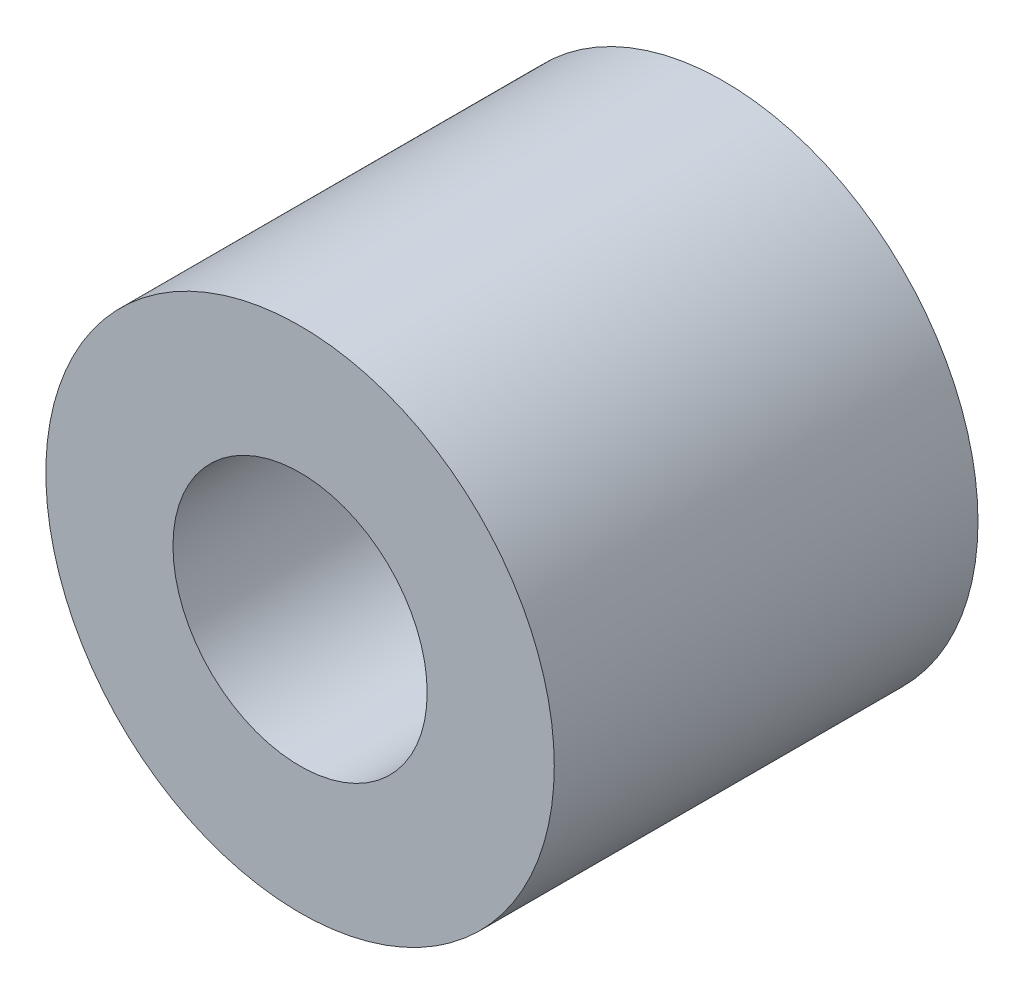
ISO-10303-21;
HEADER;
FILE_DESCRIPTION(('STEP AP214'),'2;1');
FILE_NAME('part.step','',(''),(''),'','','');
FILE_SCHEMA(('AUTOMOTIVE_DESIGN { 1 0 10303 214 1 1 1 1 }'));
ENDSEC;
DATA;
#1=APPLICATION_CONTEXT('core data for automotive mechanical design processes');
#2=APPLICATION_PROTOCOL_DEFINITION('international standard','automotive_design',2000,#1);
#3=PRODUCT_CONTEXT('',#1,'mechanical');
#4=PRODUCT('Part','Part','',(#3));
#5=PRODUCT_RELATED_PRODUCT_CATEGORY('part','',(#4));
#6=PRODUCT_DEFINITION_FORMATION('','',#4);
#7=PRODUCT_DEFINITION_CONTEXT('part definition',#1,'design');
#8=PRODUCT_DEFINITION('design','',#6,#7);
#9=PRODUCT_DEFINITION_SHAPE('','',#8);
#10=(LENGTH_UNIT() NAMED_UNIT(*) SI_UNIT(.MILLI.,.METRE.));
#11=(NAMED_UNIT(*) PLANE_ANGLE_UNIT() SI_UNIT($,.RADIAN.));
#12=(NAMED_UNIT(*) SI_UNIT($,.STERADIAN.) SOLID_ANGLE_UNIT());
#13=UNCERTAINTY_MEASURE_WITH_UNIT(LENGTH_MEASURE(1.E-05),#10,'distance_accuracy_value','');
#14=(GEOMETRIC_REPRESENTATION_CONTEXT(3) GLOBAL_UNCERTAINTY_ASSIGNED_CONTEXT((#13)) GLOBAL_UNIT_ASSIGNED_CONTEXT((#10,
#11,#12)) REPRESENTATION_CONTEXT('',''));
#15=CARTESIAN_POINT('',(0.,0.,0.));
#16=DIRECTION('',(0.,0.,1.));
#17=DIRECTION('',(1.,0.,0.));
#18=AXIS2_PLACEMENT_3D('',#15,#16,#17);
#19=CARTESIAN_POINT('',(0.,0.,5.));
#20=DIRECTION('',(0.,0.,1.));
#21=DIRECTION('',(1.,0.,0.));
#22=AXIS2_PLACEMENT_3D('',#19,#20,#21);
#23=PLANE('',#22);
#24=CARTESIAN_POINT('',(0.,0.,5.));
#25=DIRECTION('',(0.,0.,1.));
#26=DIRECTION('',(1.,0.,0.));
#27=AXIS2_PLACEMENT_3D('',#24,#25,#26);
#28=CIRCLE('',#27,3.);
#29=CARTESIAN_POINT('',(3.,0.,5.));
#30=VERTEX_POINT('',#29);
#31=EDGE_CURVE('E11',#30,#30,#28,.T.);
#32=ORIENTED_EDGE('',*,*,#31,.T.);
#33=EDGE_LOOP('',(#32));
#34=FACE_BOUND('',#33,.T.);
#35=CARTESIAN_POINT('',(0.,0.,5.));
#36=DIRECTION('',(0.,0.,1.));
#37=DIRECTION('',(1.,0.,0.));
#38=AXIS2_PLACEMENT_3D('',#35,#36,#37);
#39=CIRCLE('',#38,1.5);
#40=CARTESIAN_POINT('',(1.5,0.,5.));
#41=VERTEX_POINT('',#40);
#42=EDGE_CURVE('E48',#41,#41,#39,.T.);
#43=ORIENTED_EDGE('',*,*,#42,.F.);
#44=EDGE_LOOP('',(#43));
#45=FACE_BOUND('',#44,.T.);
#46=ADVANCED_FACE('F37',(#34,#45),#23,.T.);
#47=CARTESIAN_POINT('',(0.,0.,0.));
#48=DIRECTION('',(0.,0.,1.));
#49=DIRECTION('',(1.,0.,0.));
#50=AXIS2_PLACEMENT_3D('',#47,#48,#49);
#51=PLANE('',#50);
#52=CARTESIAN_POINT('',(0.,0.,0.));
#53=DIRECTION('',(0.,0.,1.));
#54=DIRECTION('',(1.,0.,0.));
#55=AXIS2_PLACEMENT_3D('',#52,#53,#54);
#56=CIRCLE('',#55,3.);
#57=CARTESIAN_POINT('',(3.,0.,0.));
#58=VERTEX_POINT('',#57);
#59=EDGE_CURVE('E41',#58,#58,#56,.T.);
#60=ORIENTED_EDGE('',*,*,#59,.F.);
#61=EDGE_LOOP('',(#60));
#62=FACE_BOUND('',#61,.T.);
#63=CARTESIAN_POINT('',(0.,0.,0.));
#64=DIRECTION('',(0.,0.,1.));
#65=DIRECTION('',(1.,0.,0.));
#66=AXIS2_PLACEMENT_3D('',#63,#64,#65);
#67=CIRCLE('',#66,1.5);
#68=CARTESIAN_POINT('',(1.5,0.,0.));
#69=VERTEX_POINT('',#68);
#70=EDGE_CURVE('E50',#69,#69,#67,.T.);
#71=ORIENTED_EDGE('',*,*,#70,.T.);
#72=EDGE_LOOP('',(#71));
#73=FACE_BOUND('',#72,.T.);
#74=ADVANCED_FACE('F60',(#62,#73),#51,.F.);
#75=CARTESIAN_POINT('',(0.,0.,5.));
#76=DIRECTION('',(0.,0.,-1.));
#77=DIRECTION('',(-1.,0.,0.));
#78=AXIS2_PLACEMENT_3D('',#75,#76,#77);
#79=CYLINDRICAL_SURFACE('',#78,3.);
#80=ORIENTED_EDGE('',*,*,#31,.F.);
#81=EDGE_LOOP('',(#80));
#82=FACE_BOUND('',#81,.T.);
#83=ORIENTED_EDGE('',*,*,#59,.T.);
#84=EDGE_LOOP('',(#83));
#85=FACE_BOUND('',#84,.T.);
#86=ADVANCED_FACE('F39',(#82,#85),#79,.T.);
#87=CARTESIAN_POINT('',(0.,0.,5.));
#88=DIRECTION('',(0.,0.,-1.));
#89=DIRECTION('',(-1.,0.,0.));
#90=AXIS2_PLACEMENT_3D('',#87,#88,#89);
#91=CYLINDRICAL_SURFACE('',#90,1.5);
#92=ORIENTED_EDGE('',*,*,#42,.T.);
#93=EDGE_LOOP('',(#92));
#94=FACE_BOUND('',#93,.T.);
#95=ORIENTED_EDGE('',*,*,#70,.F.);
#96=EDGE_LOOP('',(#95));
#97=FACE_BOUND('',#96,.T.);
#98=ADVANCED_FACE('F56',(#94,#97),#91,.F.);
#99=CLOSED_SHELL('',(#46,#74,#86,#98));
#100=MANIFOLD_SOLID_BREP('B2',#99);
#101=ADVANCED_BREP_SHAPE_REPRESENTATION('',(#18,#100),#14);
#102=SHAPE_DEFINITION_REPRESENTATION(#9,#101);
ENDSEC;
END-ISO-10303-21;
